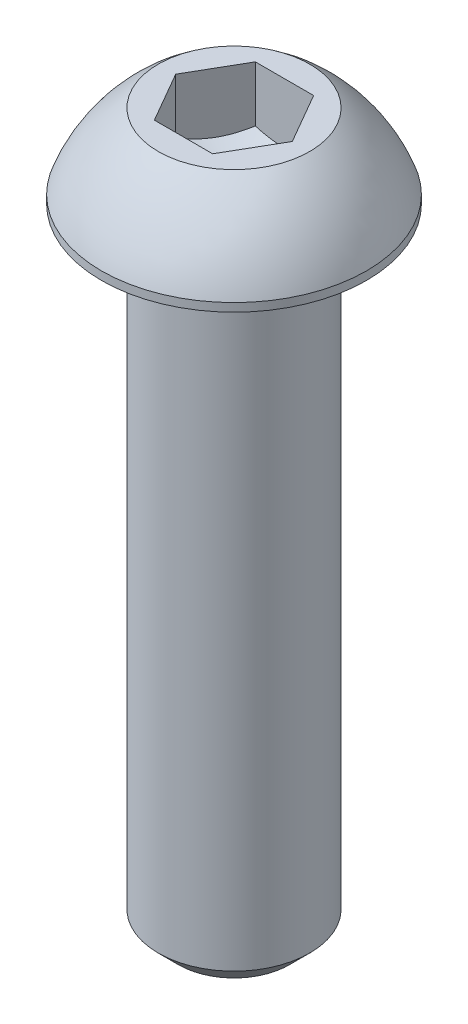
ISO-10303-21;
HEADER;
FILE_DESCRIPTION(('STEP AP214'),'2;1');
FILE_NAME('part.step','',(''),(''),'','','');
FILE_SCHEMA(('AUTOMOTIVE_DESIGN { 1 0 10303 214 1 1 1 1 }'));
ENDSEC;
DATA;
#1=APPLICATION_CONTEXT('core data for automotive mechanical design processes');
#2=APPLICATION_PROTOCOL_DEFINITION('international standard','automotive_design',2000,#1);
#3=PRODUCT_CONTEXT('',#1,'mechanical');
#4=PRODUCT('Part','Part','',(#3));
#5=PRODUCT_RELATED_PRODUCT_CATEGORY('part','',(#4));
#6=PRODUCT_DEFINITION_FORMATION('','',#4);
#7=PRODUCT_DEFINITION_CONTEXT('part definition',#1,'design');
#8=PRODUCT_DEFINITION('design','',#6,#7);
#9=PRODUCT_DEFINITION_SHAPE('','',#8);
#10=(LENGTH_UNIT() NAMED_UNIT(*) SI_UNIT(.MILLI.,.METRE.));
#11=(NAMED_UNIT(*) PLANE_ANGLE_UNIT() SI_UNIT($,.RADIAN.));
#12=(NAMED_UNIT(*) SI_UNIT($,.STERADIAN.) SOLID_ANGLE_UNIT());
#13=UNCERTAINTY_MEASURE_WITH_UNIT(LENGTH_MEASURE(1.E-05),#10,'distance_accuracy_value','');
#14=(GEOMETRIC_REPRESENTATION_CONTEXT(3) GLOBAL_UNCERTAINTY_ASSIGNED_CONTEXT((#13)) GLOBAL_UNIT_ASSIGNED_CONTEXT((#10,
#11,#12)) REPRESENTATION_CONTEXT('',''));
#15=CARTESIAN_POINT('',(0.,0.,0.));
#16=DIRECTION('',(0.,0.,1.));
#17=DIRECTION('',(1.,0.,0.));
#18=AXIS2_PLACEMENT_3D('',#15,#16,#17);
#19=CARTESIAN_POINT('',(0.,-5.02422685770377,0.));
#20=DIRECTION('',(0.,1.,0.));
#21=DIRECTION('',(0.,0.,1.));
#22=AXIS2_PLACEMENT_3D('',#19,#20,#21);
#23=DEGENERATE_TOROIDAL_SURFACE('',#22,0.546779452168978,6.15,.F.);
#24=CARTESIAN_POINT('',(0.,0.,0.));
#25=DIRECTION('',(0.,1.,0.));
#26=DIRECTION('',(0.,0.,1.));
#27=AXIS2_PLACEMENT_3D('',#24,#25,#26);
#28=CIRCLE('',#27,3.);
#29=CARTESIAN_POINT('',(0.,0.,3.));
#30=VERTEX_POINT('',#29);
#31=EDGE_CURVE('E11',#30,#30,#28,.T.);
#32=ORIENTED_EDGE('',*,*,#31,.F.);
#33=EDGE_LOOP('',(#32));
#34=FACE_BOUND('',#33,.T.);
#35=CARTESIAN_POINT('',(0.,-2.97,0.));
#36=DIRECTION('',(0.,1.,0.));
#37=DIRECTION('',(0.,0.,1.));
#38=AXIS2_PLACEMENT_3D('',#35,#36,#37);
#39=CIRCLE('',#38,5.25);
#40=CARTESIAN_POINT('',(0.,-2.97,5.25));
#41=VERTEX_POINT('',#40);
#42=EDGE_CURVE('E196',#41,#41,#39,.T.);
#43=ORIENTED_EDGE('',*,*,#42,.T.);
#44=EDGE_LOOP('',(#43));
#45=FACE_BOUND('',#44,.T.);
#46=ADVANCED_FACE('F33',(#34,#45),#23,.F.);
#47=CARTESIAN_POINT('',(2.3094010767585,0.,0.));
#48=DIRECTION('',(0.,-1.,0.));
#49=DIRECTION('',(0.,0.,-1.));
#50=AXIS2_PLACEMENT_3D('',#47,#48,#49);
#51=PLANE('',#50);
#52=DIRECTION('',(0.5,0.,0.866025403784439));
#53=VECTOR('',#52,1.);
#54=CARTESIAN_POINT('',(-2.3094010767585,0.,0.));
#55=LINE('',#54,#53);
#56=CARTESIAN_POINT('',(-2.3094010767585,0.,0.));
#57=VERTEX_POINT('',#56);
#58=CARTESIAN_POINT('',(-1.15470053837925,0.,2.));
#59=VERTEX_POINT('',#58);
#60=EDGE_CURVE('E241',#57,#59,#55,.T.);
#61=ORIENTED_EDGE('',*,*,#60,.F.);
#62=DIRECTION('',(-0.5,0.,0.866025403784439));
#63=VECTOR('',#62,1.);
#64=CARTESIAN_POINT('',(-1.15470053837925,0.,-2.));
#65=LINE('',#64,#63);
#66=CARTESIAN_POINT('',(-1.15470053837925,0.,-2.));
#67=VERTEX_POINT('',#66);
#68=EDGE_CURVE('E239',#67,#57,#65,.T.);
#69=ORIENTED_EDGE('',*,*,#68,.F.);
#70=DIRECTION('',(-1.,0.,0.));
#71=VECTOR('',#70,1.);
#72=CARTESIAN_POINT('',(1.15470053837925,0.,-2.));
#73=LINE('',#72,#71);
#74=CARTESIAN_POINT('',(1.15470053837925,0.,-2.));
#75=VERTEX_POINT('',#74);
#76=EDGE_CURVE('E110',#75,#67,#73,.T.);
#77=ORIENTED_EDGE('',*,*,#76,.F.);
#78=DIRECTION('',(-0.5,0.,-0.866025403784439));
#79=VECTOR('',#78,1.);
#80=CARTESIAN_POINT('',(2.3094010767585,0.,0.));
#81=LINE('',#80,#79);
#82=CARTESIAN_POINT('',(2.3094010767585,0.,0.));
#83=VERTEX_POINT('',#82);
#84=EDGE_CURVE('E109',#83,#75,#81,.T.);
#85=ORIENTED_EDGE('',*,*,#84,.F.);
#86=DIRECTION('',(0.5,0.,-0.866025403784439));
#87=VECTOR('',#86,1.);
#88=CARTESIAN_POINT('',(1.15470053837925,0.,2.));
#89=LINE('',#88,#87);
#90=CARTESIAN_POINT('',(1.15470053837925,0.,2.));
#91=VERTEX_POINT('',#90);
#92=EDGE_CURVE('E105',#91,#83,#89,.T.);
#93=ORIENTED_EDGE('',*,*,#92,.F.);
#94=DIRECTION('',(1.,0.,0.));
#95=VECTOR('',#94,1.);
#96=CARTESIAN_POINT('',(-1.15470053837925,0.,2.));
#97=LINE('',#96,#95);
#98=EDGE_CURVE('E242',#59,#91,#97,.T.);
#99=ORIENTED_EDGE('',*,*,#98,.F.);
#100=EDGE_LOOP('',(#61,#69,#77,#85,#93,#99));
#101=FACE_BOUND('',#100,.T.);
#102=ORIENTED_EDGE('',*,*,#31,.T.);
#103=EDGE_LOOP('',(#102));
#104=FACE_BOUND('',#103,.T.);
#105=ADVANCED_FACE('F185',(#101,#104),#51,.F.);
#106=CARTESIAN_POINT('',(2.2,-28.3,0.));
#107=DIRECTION('',(0.,1.,0.));
#108=DIRECTION('',(0.,0.,1.));
#109=AXIS2_PLACEMENT_3D('',#106,#107,#108);
#110=PLANE('',#109);
#111=CARTESIAN_POINT('',(0.,-28.3,0.));
#112=DIRECTION('',(0.,1.,0.));
#113=DIRECTION('',(0.,0.,1.));
#114=AXIS2_PLACEMENT_3D('',#111,#112,#113);
#115=CIRCLE('',#114,2.2);
#116=CARTESIAN_POINT('',(0.,-28.3,2.2));
#117=VERTEX_POINT('',#116);
#118=EDGE_CURVE('E40',#117,#117,#115,.T.);
#119=ORIENTED_EDGE('',*,*,#118,.F.);
#120=EDGE_LOOP('',(#119));
#121=FACE_BOUND('',#120,.T.);
#122=ADVANCED_FACE('F190',(#121),#110,.F.);
#123=CARTESIAN_POINT('',(0.,-28.3,0.));
#124=DIRECTION('',(0.,1.,0.));
#125=DIRECTION('',(0.,0.,1.));
#126=AXIS2_PLACEMENT_3D('',#123,#124,#125);
#127=CONICAL_SURFACE('',#126,2.2,0.785398163397449);
#128=CARTESIAN_POINT('',(0.,-27.5,0.));
#129=DIRECTION('',(0.,1.,0.));
#130=DIRECTION('',(0.,0.,1.));
#131=AXIS2_PLACEMENT_3D('',#128,#129,#130);
#132=CIRCLE('',#131,3.);
#133=CARTESIAN_POINT('',(0.,-27.5,3.));
#134=VERTEX_POINT('',#133);
#135=EDGE_CURVE('E210',#134,#134,#132,.T.);
#136=ORIENTED_EDGE('',*,*,#135,.F.);
#137=EDGE_LOOP('',(#136));
#138=FACE_BOUND('',#137,.T.);
#139=ORIENTED_EDGE('',*,*,#118,.T.);
#140=EDGE_LOOP('',(#139));
#141=FACE_BOUND('',#140,.T.);
#142=ADVANCED_FACE('F215',(#138,#141),#127,.T.);
#143=CARTESIAN_POINT('',(0.,-3.53333333333335,0.));
#144=DIRECTION('',(0.,1.,0.));
#145=DIRECTION('',(0.,0.,1.));
#146=AXIS2_PLACEMENT_3D('',#143,#144,#145);
#147=CYLINDRICAL_SURFACE('',#146,3.);
#148=CARTESIAN_POINT('',(0.,-3.05,0.));
#149=DIRECTION('',(0.,1.,0.));
#150=DIRECTION('',(0.,0.,1.));
#151=AXIS2_PLACEMENT_3D('',#148,#149,#150);
#152=CIRCLE('',#151,3.);
#153=CARTESIAN_POINT('',(0.,-3.05,3.));
#154=VERTEX_POINT('',#153);
#155=EDGE_CURVE('E207',#154,#154,#152,.T.);
#156=ORIENTED_EDGE('',*,*,#155,.F.);
#157=EDGE_LOOP('',(#156));
#158=FACE_BOUND('',#157,.T.);
#159=ORIENTED_EDGE('',*,*,#135,.T.);
#160=EDGE_LOOP('',(#159));
#161=FACE_BOUND('',#160,.T.);
#162=ADVANCED_FACE('F222',(#158,#161),#147,.T.);
#163=CARTESIAN_POINT('',(0.,-3.05,0.));
#164=DIRECTION('',(0.,1.,0.));
#165=DIRECTION('',(0.,0.,1.));
#166=AXIS2_PLACEMENT_3D('',#163,#164,#165);
#167=TOROIDAL_SURFACE('',#166,3.25,0.25);
#168=CARTESIAN_POINT('',(0.,-3.3,0.));
#169=DIRECTION('',(0.,1.,0.));
#170=DIRECTION('',(0.,0.,1.));
#171=AXIS2_PLACEMENT_3D('',#168,#169,#170);
#172=CIRCLE('',#171,3.25);
#173=CARTESIAN_POINT('',(0.,-3.3,3.25));
#174=VERTEX_POINT('',#173);
#175=EDGE_CURVE('E201',#174,#174,#172,.T.);
#176=ORIENTED_EDGE('',*,*,#175,.F.);
#177=EDGE_LOOP('',(#176));
#178=FACE_BOUND('',#177,.T.);
#179=ORIENTED_EDGE('',*,*,#155,.T.);
#180=EDGE_LOOP('',(#179));
#181=FACE_BOUND('',#180,.T.);
#182=ADVANCED_FACE('F299',(#178,#181),#167,.F.);
#183=CARTESIAN_POINT('',(3.25,-3.3,0.));
#184=DIRECTION('',(0.,1.,0.));
#185=DIRECTION('',(0.,0.,1.));
#186=AXIS2_PLACEMENT_3D('',#183,#184,#185);
#187=PLANE('',#186);
#188=CARTESIAN_POINT('',(0.,-3.3,0.));
#189=DIRECTION('',(0.,1.,0.));
#190=DIRECTION('',(0.,0.,1.));
#191=AXIS2_PLACEMENT_3D('',#188,#189,#190);
#192=CIRCLE('',#191,5.25);
#193=CARTESIAN_POINT('',(0.,-3.3,5.25));
#194=VERTEX_POINT('',#193);
#195=EDGE_CURVE('E198',#194,#194,#192,.T.);
#196=ORIENTED_EDGE('',*,*,#195,.F.);
#197=EDGE_LOOP('',(#196));
#198=FACE_BOUND('',#197,.T.);
#199=ORIENTED_EDGE('',*,*,#175,.T.);
#200=EDGE_LOOP('',(#199));
#201=FACE_BOUND('',#200,.T.);
#202=ADVANCED_FACE('F291',(#198,#201),#187,.F.);
#203=CARTESIAN_POINT('',(0.,-3.53333333333335,0.));
#204=DIRECTION('',(0.,1.,0.));
#205=DIRECTION('',(0.,0.,1.));
#206=AXIS2_PLACEMENT_3D('',#203,#204,#205);
#207=CYLINDRICAL_SURFACE('',#206,5.25);
#208=ORIENTED_EDGE('',*,*,#42,.F.);
#209=EDGE_LOOP('',(#208));
#210=FACE_BOUND('',#209,.T.);
#211=ORIENTED_EDGE('',*,*,#195,.T.);
#212=EDGE_LOOP('',(#211));
#213=FACE_BOUND('',#212,.T.);
#214=ADVANCED_FACE('F140',(#210,#213),#207,.T.);
#215=CARTESIAN_POINT('',(1.15470053837925,-28.301,2.));
#216=DIRECTION('',(0.866025403784439,0.,0.5));
#217=DIRECTION('',(0.5,0.,-0.866025403784439));
#218=AXIS2_PLACEMENT_3D('',#215,#216,#217);
#219=PLANE('',#218);
#220=CARTESIAN_POINT('',(1.15458506832541,-2.19993332833358,2.0002));
#221=CARTESIAN_POINT('',(1.20532911262018,-2.2292432588534,1.91230873709994));
#222=CARTESIAN_POINT('',(1.2565111744778,-2.25589994297362,1.82365880552641));
#223=CARTESIAN_POINT('',(1.35976164019319,-2.30243030393336,1.6448237530022));
#224=CARTESIAN_POINT('',(1.41183187919145,-2.3222875185713,1.55463545349496));
#225=CARTESIAN_POINT('',(1.51532701829183,-2.35319933093083,1.37537661423669));
#226=CARTESIAN_POINT('',(1.56673599086578,-2.36445964335555,1.2863336617737));
#227=CARTESIAN_POINT('',(1.66979593505373,-2.37790413235944,1.10782860221496));
#228=CARTESIAN_POINT('',(1.72144653186531,-2.38009944000062,1.01836714429604));
#229=CARTESIAN_POINT('',(1.81796535054794,-2.37554180562344,0.851191646451201));
#230=CARTESIAN_POINT('',(1.86284799277603,-2.36990792026707,0.773452629734215));
#231=CARTESIAN_POINT('',(1.95232085557725,-2.35204889969325,0.618481085463866));
#232=CARTESIAN_POINT('',(1.99691076648954,-2.33981765893064,0.541249094258801));
#233=CARTESIAN_POINT('',(2.08656822922816,-2.30923935808647,0.385957813517799));
#234=CARTESIAN_POINT('',(2.13162442866767,-2.29076262788837,0.30791818689262));
#235=CARTESIAN_POINT('',(2.221064675979,-2.24882727674123,0.153003134307865));
#236=CARTESIAN_POINT('',(2.26544987045196,-2.22537851446177,0.0761257223768799));
#237=CARTESIAN_POINT('',(2.30951654681234,-2.19993332833358,-0.000200000000000064));
#238=B_SPLINE_CURVE_WITH_KNOTS('',3,(#220,#221,#222,#223,#224,#225,#226,#227,#228,#229,#230,
#231,#232,#233,#234,#235,#236,#237),.UNSPECIFIED.,.F.,.F.,(4,2,2,2,2,2,2,2,4),(0.,
0.317031824695611,0.634825876346565,0.944753967652638,1.25430138000371,1.52387047293094,
1.79368946861028,2.06949491027634,2.34475850821472),.UNSPECIFIED.);
#239=CARTESIAN_POINT('',(1.15470053837925,-2.2,2.));
#240=VERTEX_POINT('',#239);
#241=CARTESIAN_POINT('',(2.3094010767585,-2.2,0.));
#242=VERTEX_POINT('',#241);
#243=EDGE_CURVE('E90',#240,#242,#238,.T.);
#244=ORIENTED_EDGE('',*,*,#243,.F.);
#245=DIRECTION('',(0.,1.,0.));
#246=VECTOR('',#245,1.);
#247=CARTESIAN_POINT('',(1.15470053837925,-28.301,2.));
#248=LINE('',#247,#246);
#249=EDGE_CURVE('E132',#240,#91,#248,.T.);
#250=ORIENTED_EDGE('',*,*,#249,.T.);
#251=ORIENTED_EDGE('',*,*,#92,.T.);
#252=DIRECTION('',(0.,1.,0.));
#253=VECTOR('',#252,1.);
#254=CARTESIAN_POINT('',(2.3094010767585,-28.301,0.));
#255=LINE('',#254,#253);
#256=EDGE_CURVE('E102',#242,#83,#255,.T.);
#257=ORIENTED_EDGE('',*,*,#256,.F.);
#258=EDGE_LOOP('',(#244,#250,#251,#257));
#259=FACE_BOUND('',#258,.T.);
#260=ADVANCED_FACE('F103',(#259),#219,.F.);
#261=CARTESIAN_POINT('',(-1.15470053837925,-28.301,2.));
#262=DIRECTION('',(0.,0.,1.));
#263=DIRECTION('',(1.,0.,0.));
#264=AXIS2_PLACEMENT_3D('',#261,#262,#263);
#265=PLANE('',#264);
#266=CARTESIAN_POINT('',(-3.0849581541306,-1.41068036964717,2.));
#267=CARTESIAN_POINT('',(-2.99766543017809,-1.45295760796416,2.));
#268=CARTESIAN_POINT('',(-2.91017034160145,-1.49482427641553,2.));
#269=CARTESIAN_POINT('',(-2.73466759208958,-1.57750492817978,2.));
#270=CARTESIAN_POINT('',(-2.64665985112343,-1.61831874142092,2.));
#271=CARTESIAN_POINT('',(-2.46956337081323,-1.69887062603104,2.));
#272=CARTESIAN_POINT('',(-2.38047134462574,-1.73860149646673,2.));
#273=CARTESIAN_POINT('',(-2.2015718476664,-1.81641219683768,2.));
#274=CARTESIAN_POINT('',(-2.1117644116587,-1.85449210642627,2.));
#275=CARTESIAN_POINT('',(-1.92862102490902,-1.92965973110084,2.));
#276=CARTESIAN_POINT('',(-1.83525924045821,-1.96668485017817,2.));
#277=CARTESIAN_POINT('',(-1.64743777577972,-2.0378921973819,2.));
#278=CARTESIAN_POINT('',(-1.55297797313482,-2.07207410498797,2.));
#279=CARTESIAN_POINT('',(-1.36299163476084,-2.13668664252341,2.));
#280=CARTESIAN_POINT('',(-1.26746774339968,-2.16712496895606,2.));
#281=CARTESIAN_POINT('',(-1.07505107636687,-2.22326353469148,2.));
#282=CARTESIAN_POINT('',(-0.978158746446534,-2.24896528022328,2.));
#283=CARTESIAN_POINT('',(-0.783404665318423,-2.29427082588854,2.));
#284=CARTESIAN_POINT('',(-0.685549467717741,-2.31390227122064,2.));
#285=CARTESIAN_POINT('',(-0.488642629812028,-2.34591811351208,2.));
#286=CARTESIAN_POINT('',(-0.389591122621831,-2.35830330932447,2.));
#287=CARTESIAN_POINT('',(-0.192060125994615,-2.37467413641327,2.));
#288=CARTESIAN_POINT('',(-0.0935896813136737,-2.37876581880314,2.));
#289=CARTESIAN_POINT('',(0.103341121324972,-2.3784929086923,2.));
#290=CARTESIAN_POINT('',(0.201801478061756,-2.37412771283695,2.));
#291=CARTESIAN_POINT('',(0.438798722528343,-2.35382325444844,2.));
#292=CARTESIAN_POINT('',(0.576989244582384,-2.33382858643173,2.));
#293=CARTESIAN_POINT('',(0.850826918333926,-2.28071935415277,2.));
#294=CARTESIAN_POINT('',(0.986471683297119,-2.24759306489467,2.));
#295=CARTESIAN_POINT('',(1.1895399311439,-2.1902752520876,2.));
#296=CARTESIAN_POINT('',(1.25799528411415,-2.16959675114176,2.));
#297=CARTESIAN_POINT('',(1.39423566078482,-2.12612970296368,2.));
#298=CARTESIAN_POINT('',(1.46202067876326,-2.10334113773711,2.));
#299=CARTESIAN_POINT('',(1.59695313243604,-2.05601745110539,2.));
#300=CARTESIAN_POINT('',(1.66410073522683,-2.03148280261198,2.));
#301=CARTESIAN_POINT('',(1.79783762290384,-1.98095088928442,2.));
#302=CARTESIAN_POINT('',(1.86442693421213,-1.95495369412178,2.));
#303=CARTESIAN_POINT('',(2.10330581178623,-1.85917840900619,2.));
#304=CARTESIAN_POINT('',(2.27419941753904,-1.78592122461016,2.));
#305=CARTESIAN_POINT('',(2.61368098697309,-1.63422313171324,2.));
#306=CARTESIAN_POINT('',(2.78226832679374,-1.55578085281397,2.));
#307=CARTESIAN_POINT('',(3.11790398602245,-1.39538530414152,2.));
#308=CARTESIAN_POINT('',(3.28495114088383,-1.31342960625293,2.));
#309=CARTESIAN_POINT('',(3.61785293628129,-1.14712864774346,2.));
#310=CARTESIAN_POINT('',(3.78370753421074,-1.06278330227397,2.));
#311=CARTESIAN_POINT('',(4.11493850775416,-0.892177540551467,2.));
#312=CARTESIAN_POINT('',(4.2803127327843,-0.805912958019159,2.));
#313=CARTESIAN_POINT('',(4.61039699006896,-0.632115052119748,2.));
#314=CARTESIAN_POINT('',(4.77510700588207,-0.544581697589728,2.));
#315=CARTESIAN_POINT('',(5.26833196743844,-0.280645110510281,2.));
#316=CARTESIAN_POINT('',(5.59608985704422,-0.10282831164603,2.));
#317=CARTESIAN_POINT('',(6.19822090407161,0.226558703598804,2.));
#318=CARTESIAN_POINT('',(6.47277728422422,0.377795477688123,2.));
#319=CARTESIAN_POINT('',(7.02129770497367,0.681423649561265,2.));
#320=CARTESIAN_POINT('',(7.29526166352891,0.833815195557927,2.));
#321=CARTESIAN_POINT('',(7.84155155401148,1.13874956433497,2.));
#322=CARTESIAN_POINT('',(8.11387944525776,1.29128888130212,2.));
#323=CARTESIAN_POINT('',(8.65815243356726,1.59696037846536,2.));
#324=CARTESIAN_POINT('',(8.93009757871977,1.75009247301118,2.));
#325=CARTESIAN_POINT('',(9.20192291993456,1.90343609419801,2.));
#326=B_SPLINE_CURVE_WITH_KNOTS('',3,(#266,#267,#268,#269,#270,#271,#272,#273,#274,#275,#276,
#277,#278,#279,#280,#281,#282,#283,#284,#285,#286,#287,#288,#289,#290,#291,#292,#293,#294,#295,
#296,#297,#298,#299,#300,#301,#302,#303,#304,#305,#306,#307,#308,#309,#310,#311,#312,#313,#314,
#315,#316,#317,#318,#319,#320,#321,#322,#323,#324,#325),.UNSPECIFIED.,.F.,.F.,(4,2,2,2,2,2,2,2,
2,2,2,2,2,2,2,2,2,2,2,2,2,2,2,2,2,2,2,2,2,4),(0.,0.290978670543673,0.582004053337613,
0.874639560639555,1.16726093351149,1.46853154077375,1.76983606491162,2.07051039139722,
2.37108893806998,2.67027772044415,2.96943351293459,3.26473916432925,3.5600658850344,
3.97810045989404,4.39650913432107,4.61101431490362,4.82552132492464,5.03997045704444,
5.25440938205928,5.81204587619302,6.36983034516112,6.92800671612027,7.48620293100573,
8.04575953545993,8.60532990681916,9.72397005011728,10.6643315072183,11.6048157742896,
12.5412318312371,13.477517291472),.UNSPECIFIED.);
#327=CARTESIAN_POINT('',(-1.15470053837925,-2.2,2.));
#328=VERTEX_POINT('',#327);
#329=EDGE_CURVE('E97',#328,#240,#326,.T.);
#330=ORIENTED_EDGE('',*,*,#329,.F.);
#331=DIRECTION('',(0.,1.,0.));
#332=VECTOR('',#331,1.);
#333=CARTESIAN_POINT('',(-1.15470053837925,-28.301,2.));
#334=LINE('',#333,#332);
#335=EDGE_CURVE('E246',#328,#59,#334,.T.);
#336=ORIENTED_EDGE('',*,*,#335,.T.);
#337=ORIENTED_EDGE('',*,*,#98,.T.);
#338=ORIENTED_EDGE('',*,*,#249,.F.);
#339=EDGE_LOOP('',(#330,#336,#337,#338));
#340=FACE_BOUND('',#339,.T.);
#341=ADVANCED_FACE('F177',(#340),#265,.F.);
#342=CARTESIAN_POINT('',(-2.3094010767585,-28.301,0.));
#343=DIRECTION('',(-0.866025403784439,0.,0.5));
#344=DIRECTION('',(0.5,0.,0.866025403784439));
#345=AXIS2_PLACEMENT_3D('',#342,#343,#344);
#346=PLANE('',#345);
#347=CARTESIAN_POINT('',(-2.30951654681234,-2.19993332833358,-0.00019999999999938));
#348=CARTESIAN_POINT('',(-2.25877250251758,-2.2292432588534,0.0876912629000606));
#349=CARTESIAN_POINT('',(-2.20759044065995,-2.25589994297362,0.176341194473592));
#350=CARTESIAN_POINT('',(-2.10433997494456,-2.30243030393336,0.355176246997803));
#351=CARTESIAN_POINT('',(-2.0522697359463,-2.3222875185713,0.445364546505038));
#352=CARTESIAN_POINT('',(-1.94877459684592,-2.35319933093083,0.624623385763308));
#353=CARTESIAN_POINT('',(-1.89736562427197,-2.36445964335555,0.713666338226306));
#354=CARTESIAN_POINT('',(-1.79430568008402,-2.37790413235944,0.892171397785045));
#355=CARTESIAN_POINT('',(-1.74265508327244,-2.38009944000062,0.98163285570396));
#356=CARTESIAN_POINT('',(-1.64613626458981,-2.37554180562344,1.1488083535488));
#357=CARTESIAN_POINT('',(-1.60125362236172,-2.36990792026707,1.22654737026579));
#358=CARTESIAN_POINT('',(-1.51178075956051,-2.35204889969325,1.38151891453614));
#359=CARTESIAN_POINT('',(-1.46719084864821,-2.33981765893064,1.4587509057412));
#360=CARTESIAN_POINT('',(-1.37753338590959,-2.30923935808647,1.6140421864822));
#361=CARTESIAN_POINT('',(-1.33247718647009,-2.29076262788837,1.69208181310738));
#362=CARTESIAN_POINT('',(-1.24303693915875,-2.24882727674123,1.84699686569214));
#363=CARTESIAN_POINT('',(-1.1986517446858,-2.22537851446177,1.92387427762312));
#364=CARTESIAN_POINT('',(-1.15458506832541,-2.19993332833358,2.0002));
#365=B_SPLINE_CURVE_WITH_KNOTS('',3,(#347,#348,#349,#350,#351,#352,#353,#354,#355,#356,#357,
#358,#359,#360,#361,#362,#363,#364),.UNSPECIFIED.,.F.,.F.,(4,2,2,2,2,2,2,2,4),(0.,
0.317031824695611,0.634825876346565,0.944753967652638,1.25430138000371,1.52387047293094,
1.79368946861028,2.06949491027634,2.34475850821473),.UNSPECIFIED.);
#366=CARTESIAN_POINT('',(-2.3094010767585,-2.2,0.));
#367=VERTEX_POINT('',#366);
#368=EDGE_CURVE('E158',#367,#328,#365,.T.);
#369=ORIENTED_EDGE('',*,*,#368,.F.);
#370=DIRECTION('',(0.,1.,0.));
#371=VECTOR('',#370,1.);
#372=CARTESIAN_POINT('',(-2.3094010767585,-28.301,0.));
#373=LINE('',#372,#371);
#374=EDGE_CURVE('E47',#367,#57,#373,.T.);
#375=ORIENTED_EDGE('',*,*,#374,.T.);
#376=ORIENTED_EDGE('',*,*,#60,.T.);
#377=ORIENTED_EDGE('',*,*,#335,.F.);
#378=EDGE_LOOP('',(#369,#375,#376,#377));
#379=FACE_BOUND('',#378,.T.);
#380=ADVANCED_FACE('F173',(#379),#346,.F.);
#381=CARTESIAN_POINT('',(-1.15470053837925,-28.301,-2.));
#382=DIRECTION('',(-0.866025403784439,0.,-0.5));
#383=DIRECTION('',(-0.5,0.,0.866025403784439));
#384=AXIS2_PLACEMENT_3D('',#381,#382,#383);
#385=PLANE('',#384);
#386=CARTESIAN_POINT('',(-1.15458506832541,-2.19993332833358,-2.0002));
#387=CARTESIAN_POINT('',(-1.20532911262018,-2.2292432588534,-1.91230873709994));
#388=CARTESIAN_POINT('',(-1.2565111744778,-2.25589994297362,-1.82365880552641));
#389=CARTESIAN_POINT('',(-1.35976164019319,-2.30243030393336,-1.6448237530022));
#390=CARTESIAN_POINT('',(-1.41183187919145,-2.3222875185713,-1.55463545349496));
#391=CARTESIAN_POINT('',(-1.51532701829183,-2.35319933093083,-1.37537661423669));
#392=CARTESIAN_POINT('',(-1.56673599086578,-2.36445964335555,-1.2863336617737));
#393=CARTESIAN_POINT('',(-1.66979593505373,-2.37790413235944,-1.10782860221496));
#394=CARTESIAN_POINT('',(-1.72144653186531,-2.38009944000062,-1.01836714429604));
#395=CARTESIAN_POINT('',(-1.81796535054794,-2.37554180562344,-0.8511916464512));
#396=CARTESIAN_POINT('',(-1.86284799277603,-2.36990792026707,-0.773452629734215));
#397=CARTESIAN_POINT('',(-1.95232085557725,-2.35204889969326,-0.618481085463865));
#398=CARTESIAN_POINT('',(-1.99691076648954,-2.33981765893064,-0.5412490942588));
#399=CARTESIAN_POINT('',(-2.08656822922816,-2.30923935808647,-0.385957813517798));
#400=CARTESIAN_POINT('',(-2.13162442866767,-2.29076262788837,-0.307918186892619));
#401=CARTESIAN_POINT('',(-2.221064675979,-2.24882727674123,-0.153003134307864));
#402=CARTESIAN_POINT('',(-2.26544987045196,-2.22537851446177,-0.0761257223768793));
#403=CARTESIAN_POINT('',(-2.30951654681234,-2.19993332833358,0.000200000000000585));
#404=B_SPLINE_CURVE_WITH_KNOTS('',3,(#386,#387,#388,#389,#390,#391,#392,#393,#394,#395,#396,
#397,#398,#399,#400,#401,#402,#403),.UNSPECIFIED.,.F.,.F.,(4,2,2,2,2,2,2,2,4),(0.,
0.31703182469561,0.634825876346565,0.944753967652638,1.25430138000372,1.52387047293094,
1.79368946861028,2.06949491027634,2.34475850821473),.UNSPECIFIED.);
#405=CARTESIAN_POINT('',(-1.15470053837925,-2.2,-2.));
#406=VERTEX_POINT('',#405);
#407=EDGE_CURVE('E117',#406,#367,#404,.T.);
#408=ORIENTED_EDGE('',*,*,#407,.F.);
#409=DIRECTION('',(0.,1.,0.));
#410=VECTOR('',#409,1.);
#411=CARTESIAN_POINT('',(-1.15470053837925,-28.301,-2.));
#412=LINE('',#411,#410);
#413=EDGE_CURVE('E54',#406,#67,#412,.T.);
#414=ORIENTED_EDGE('',*,*,#413,.T.);
#415=ORIENTED_EDGE('',*,*,#68,.T.);
#416=ORIENTED_EDGE('',*,*,#374,.F.);
#417=EDGE_LOOP('',(#408,#414,#415,#416));
#418=FACE_BOUND('',#417,.T.);
#419=ADVANCED_FACE('F169',(#418),#385,.F.);
#420=CARTESIAN_POINT('',(1.15470053837925,-28.301,-2.));
#421=DIRECTION('',(0.,0.,-1.));
#422=DIRECTION('',(-1.,0.,0.));
#423=AXIS2_PLACEMENT_3D('',#420,#421,#422);
#424=PLANE('',#423);
#425=CARTESIAN_POINT('',(-3.0849581541306,-1.41068036964717,-2.));
#426=CARTESIAN_POINT('',(-2.99766543017809,-1.45295760796416,-2.));
#427=CARTESIAN_POINT('',(-2.91017034160145,-1.49482427641553,-2.));
#428=CARTESIAN_POINT('',(-2.73466759208958,-1.57750492817978,-2.));
#429=CARTESIAN_POINT('',(-2.64665985112343,-1.61831874142092,-2.));
#430=CARTESIAN_POINT('',(-2.46956337081323,-1.69887062603104,-2.));
#431=CARTESIAN_POINT('',(-2.38047134462574,-1.73860149646673,-2.));
#432=CARTESIAN_POINT('',(-2.2015718476664,-1.81641219683768,-2.));
#433=CARTESIAN_POINT('',(-2.1117644116587,-1.85449210642627,-2.));
#434=CARTESIAN_POINT('',(-1.92862102490902,-1.92965973110084,-2.));
#435=CARTESIAN_POINT('',(-1.83525924045821,-1.96668485017817,-2.));
#436=CARTESIAN_POINT('',(-1.64743777577972,-2.0378921973819,-2.));
#437=CARTESIAN_POINT('',(-1.55297797313482,-2.07207410498797,-2.));
#438=CARTESIAN_POINT('',(-1.36299163476084,-2.13668664252341,-2.));
#439=CARTESIAN_POINT('',(-1.26746774339968,-2.16712496895607,-2.));
#440=CARTESIAN_POINT('',(-1.07505107636687,-2.22326353469148,-2.));
#441=CARTESIAN_POINT('',(-0.978158746446535,-2.24896528022328,-2.));
#442=CARTESIAN_POINT('',(-0.783404665318424,-2.29427082588854,-2.));
#443=CARTESIAN_POINT('',(-0.685549467717742,-2.31390227122064,-2.));
#444=CARTESIAN_POINT('',(-0.488642629812029,-2.34591811351208,-2.));
#445=CARTESIAN_POINT('',(-0.389591122621831,-2.35830330932447,-2.));
#446=CARTESIAN_POINT('',(-0.192060125994615,-2.37467413641327,-2.));
#447=CARTESIAN_POINT('',(-0.0935896813136747,-2.37876581880314,-2.));
#448=CARTESIAN_POINT('',(0.103341121324972,-2.3784929086923,-2.));
#449=CARTESIAN_POINT('',(0.201801478061755,-2.37412771283695,-2.));
#450=CARTESIAN_POINT('',(0.438798722528342,-2.35382325444844,-2.));
#451=CARTESIAN_POINT('',(0.576989244582383,-2.33382858643173,-2.));
#452=CARTESIAN_POINT('',(0.850826918333924,-2.28071935415277,-2.));
#453=CARTESIAN_POINT('',(0.986471683297118,-2.24759306489467,-2.));
#454=CARTESIAN_POINT('',(1.1895399311439,-2.19027525208761,-2.));
#455=CARTESIAN_POINT('',(1.25799528411415,-2.16959675114176,-2.));
#456=CARTESIAN_POINT('',(1.39423566078481,-2.12612970296368,-2.));
#457=CARTESIAN_POINT('',(1.46202067876326,-2.10334113773711,-2.));
#458=CARTESIAN_POINT('',(1.59695313243604,-2.05601745110539,-2.));
#459=CARTESIAN_POINT('',(1.66410073522683,-2.03148280261199,-2.));
#460=CARTESIAN_POINT('',(1.79783762290384,-1.98095088928442,-2.));
#461=CARTESIAN_POINT('',(1.86442693421213,-1.95495369412178,-2.));
#462=CARTESIAN_POINT('',(2.10330581178623,-1.85917840900619,-2.));
#463=CARTESIAN_POINT('',(2.27419941753904,-1.78592122461016,-2.));
#464=CARTESIAN_POINT('',(2.61368098697309,-1.63422313171325,-2.));
#465=CARTESIAN_POINT('',(2.78226832679374,-1.55578085281397,-2.));
#466=CARTESIAN_POINT('',(3.11790398602245,-1.39538530414152,-2.));
#467=CARTESIAN_POINT('',(3.28495114088383,-1.31342960625293,-2.));
#468=CARTESIAN_POINT('',(3.61785293628129,-1.14712864774346,-2.));
#469=CARTESIAN_POINT('',(3.78370753421074,-1.06278330227397,-2.));
#470=CARTESIAN_POINT('',(4.11493850775416,-0.892177540551469,-2.));
#471=CARTESIAN_POINT('',(4.2803127327843,-0.80591295801916,-2.));
#472=CARTESIAN_POINT('',(4.61039699006895,-0.632115052119749,-2.));
#473=CARTESIAN_POINT('',(4.77510700588207,-0.544581697589729,-2.));
#474=CARTESIAN_POINT('',(5.26833196743844,-0.280645110510282,-2.));
#475=CARTESIAN_POINT('',(5.59608985704422,-0.102828311646033,-2.));
#476=CARTESIAN_POINT('',(6.19822090407161,0.226558703598802,-2.));
#477=CARTESIAN_POINT('',(6.47277728422422,0.377795477688122,-2.));
#478=CARTESIAN_POINT('',(7.02129770497367,0.681423649561264,-2.));
#479=CARTESIAN_POINT('',(7.29526166352891,0.833815195557926,-2.));
#480=CARTESIAN_POINT('',(7.84155155401148,1.13874956433497,-2.));
#481=CARTESIAN_POINT('',(8.11387944525776,1.29128888130212,-2.));
#482=CARTESIAN_POINT('',(8.65815243356725,1.59696037846536,-2.));
#483=CARTESIAN_POINT('',(8.93009757871977,1.75009247301117,-2.));
#484=CARTESIAN_POINT('',(9.20192291993456,1.90343609419801,-2.));
#485=B_SPLINE_CURVE_WITH_KNOTS('',3,(#425,#426,#427,#428,#429,#430,#431,#432,#433,#434,#435,
#436,#437,#438,#439,#440,#441,#442,#443,#444,#445,#446,#447,#448,#449,#450,#451,#452,#453,#454,
#455,#456,#457,#458,#459,#460,#461,#462,#463,#464,#465,#466,#467,#468,#469,#470,#471,#472,#473,
#474,#475,#476,#477,#478,#479,#480,#481,#482,#483,#484),.UNSPECIFIED.,.F.,.F.,(4,2,2,2,2,2,2,2,
2,2,2,2,2,2,2,2,2,2,2,2,2,2,2,2,2,2,2,2,2,4),(0.,0.290978670543672,0.582004053337613,
0.874639560639554,1.16726093351149,1.46853154077375,1.76983606491162,2.07051039139721,
2.37108893806998,2.67027772044415,2.96943351293459,3.26473916432925,3.56006588503439,
3.97810045989404,4.39650913432107,4.61101431490362,4.82552132492464,5.03997045704444,
5.25440938205928,5.81204587619302,6.36983034516112,6.92800671612027,7.48620293100573,
8.04575953545992,8.60532990681916,9.72397005011727,10.6643315072183,11.6048157742896,
12.5412318312371,13.477517291472),.UNSPECIFIED.);
#486=CARTESIAN_POINT('',(1.15470053837925,-2.2,-2.));
#487=VERTEX_POINT('',#486);
#488=EDGE_CURVE('E115',#487,#406,#485,.F.);
#489=ORIENTED_EDGE('',*,*,#488,.F.);
#490=DIRECTION('',(0.,1.,0.));
#491=VECTOR('',#490,1.);
#492=CARTESIAN_POINT('',(1.15470053837925,-28.301,-2.));
#493=LINE('',#492,#491);
#494=EDGE_CURVE('E113',#487,#75,#493,.T.);
#495=ORIENTED_EDGE('',*,*,#494,.T.);
#496=ORIENTED_EDGE('',*,*,#76,.T.);
#497=ORIENTED_EDGE('',*,*,#413,.F.);
#498=EDGE_LOOP('',(#489,#495,#496,#497));
#499=FACE_BOUND('',#498,.T.);
#500=ADVANCED_FACE('F172',(#499),#424,.F.);
#501=CARTESIAN_POINT('',(2.3094010767585,-28.301,0.));
#502=DIRECTION('',(0.866025403784439,0.,-0.5));
#503=DIRECTION('',(-0.5,0.,-0.866025403784439));
#504=AXIS2_PLACEMENT_3D('',#501,#502,#503);
#505=PLANE('',#504);
#506=CARTESIAN_POINT('',(2.30951654681234,-2.19993332833358,0.000199999999999748));
#507=CARTESIAN_POINT('',(2.25877250251758,-2.2292432588534,-0.0876912629000603));
#508=CARTESIAN_POINT('',(2.20759044065995,-2.25589994297362,-0.176341194473592));
#509=CARTESIAN_POINT('',(2.10433997494456,-2.30243030393336,-0.355176246997803));
#510=CARTESIAN_POINT('',(2.0522697359463,-2.3222875185713,-0.445364546505038));
#511=CARTESIAN_POINT('',(1.94877459684592,-2.35319933093083,-0.624623385763308));
#512=CARTESIAN_POINT('',(1.89736562427197,-2.36445964335555,-0.713666338226306));
#513=CARTESIAN_POINT('',(1.79430568008402,-2.37790413235944,-0.892171397785045));
#514=CARTESIAN_POINT('',(1.74265508327244,-2.38009944000062,-0.98163285570396));
#515=CARTESIAN_POINT('',(1.64613626458981,-2.37554180562344,-1.1488083535488));
#516=CARTESIAN_POINT('',(1.60125362236172,-2.36990792026707,-1.22654737026579));
#517=CARTESIAN_POINT('',(1.51178075956051,-2.35204889969326,-1.38151891453614));
#518=CARTESIAN_POINT('',(1.46719084864821,-2.33981765893064,-1.4587509057412));
#519=CARTESIAN_POINT('',(1.37753338590959,-2.30923935808647,-1.6140421864822));
#520=CARTESIAN_POINT('',(1.33247718647009,-2.29076262788837,-1.69208181310738));
#521=CARTESIAN_POINT('',(1.24303693915875,-2.24882727674123,-1.84699686569214));
#522=CARTESIAN_POINT('',(1.1986517446858,-2.22537851446177,-1.92387427762312));
#523=CARTESIAN_POINT('',(1.15458506832541,-2.19993332833358,-2.0002));
#524=B_SPLINE_CURVE_WITH_KNOTS('',3,(#506,#507,#508,#509,#510,#511,#512,#513,#514,#515,#516,
#517,#518,#519,#520,#521,#522,#523),.UNSPECIFIED.,.F.,.F.,(4,2,2,2,2,2,2,2,4),(0.,
0.317031824695611,0.634825876346565,0.944753967652638,1.25430138000371,1.52387047293094,
1.79368946861028,2.06949491027634,2.34475850821472),.UNSPECIFIED.);
#525=EDGE_CURVE('E94',#242,#487,#524,.T.);
#526=ORIENTED_EDGE('',*,*,#525,.F.);
#527=ORIENTED_EDGE('',*,*,#256,.T.);
#528=ORIENTED_EDGE('',*,*,#84,.T.);
#529=ORIENTED_EDGE('',*,*,#494,.F.);
#530=EDGE_LOOP('',(#526,#527,#528,#529));
#531=FACE_BOUND('',#530,.T.);
#532=ADVANCED_FACE('F112',(#531),#505,.F.);
#533=CARTESIAN_POINT('',(0.,-2.2,0.));
#534=DIRECTION('',(0.,1.,0.));
#535=DIRECTION('',(0.,0.,1.));
#536=AXIS2_PLACEMENT_3D('',#533,#534,#535);
#537=CONICAL_SURFACE('',#536,2.3094010767585,1.04719755119659);
#538=CARTESIAN_POINT('',(0.,-3.53333333333335,0.));
#539=VERTEX_POINT('',#538);
#540=VERTEX_LOOP('',#539);
#541=FACE_BOUND('',#540,.T.);
#542=ORIENTED_EDGE('',*,*,#243,.T.);
#543=ORIENTED_EDGE('',*,*,#525,.T.);
#544=ORIENTED_EDGE('',*,*,#488,.T.);
#545=ORIENTED_EDGE('',*,*,#407,.T.);
#546=ORIENTED_EDGE('',*,*,#368,.T.);
#547=ORIENTED_EDGE('',*,*,#329,.T.);
#548=EDGE_LOOP('',(#542,#543,#544,#545,#546,#547));
#549=FACE_BOUND('',#548,.T.);
#550=ADVANCED_FACE('F92',(#541,#549),#537,.F.);
#551=CLOSED_SHELL('',(#46,#105,#122,#142,#162,#182,#202,#214,#260,#341,#380,#419,#500,#532,#550));
#552=MANIFOLD_SOLID_BREP('B2',#551);
#553=ADVANCED_BREP_SHAPE_REPRESENTATION('',(#18,#552),#14);
#554=SHAPE_DEFINITION_REPRESENTATION(#9,#553);
ENDSEC;
END-ISO-10303-21;
